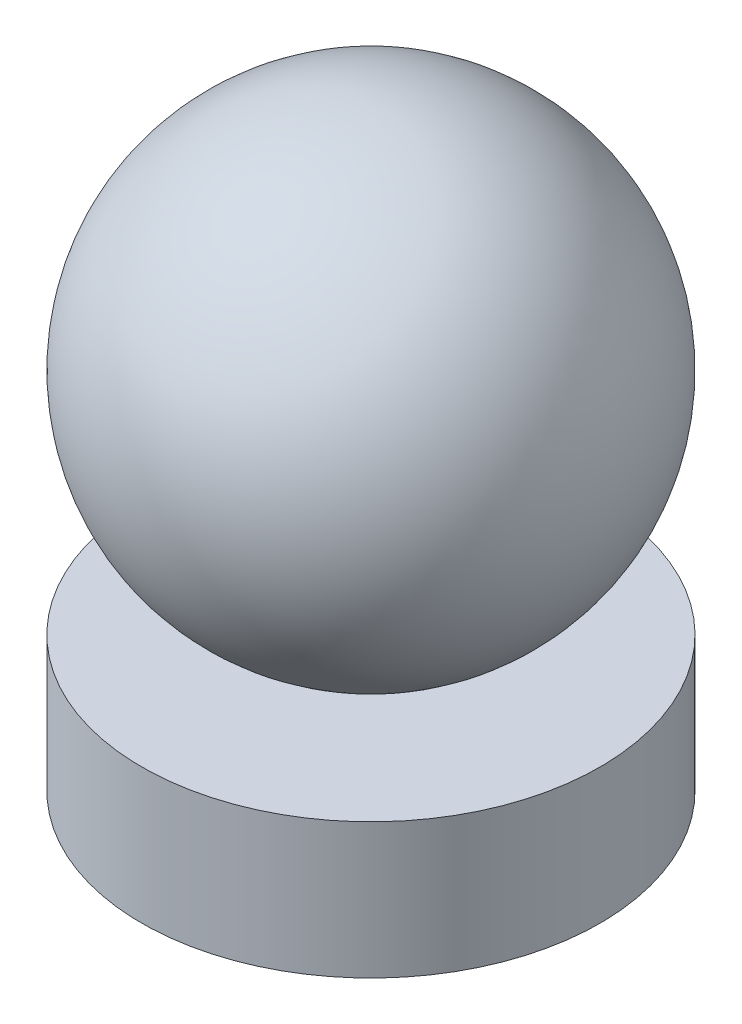
ISO-10303-21;
HEADER;
FILE_DESCRIPTION(('STEP AP214'),'2;1');
FILE_NAME('part.step','',(''),(''),'','','');
FILE_SCHEMA(('AUTOMOTIVE_DESIGN { 1 0 10303 214 1 1 1 1 }'));
ENDSEC;
DATA;
#1=APPLICATION_CONTEXT('core data for automotive mechanical design processes');
#2=APPLICATION_PROTOCOL_DEFINITION('international standard','automotive_design',2000,#1);
#3=PRODUCT_CONTEXT('',#1,'mechanical');
#4=PRODUCT('Part','Part','',(#3));
#5=PRODUCT_RELATED_PRODUCT_CATEGORY('part','',(#4));
#6=PRODUCT_DEFINITION_FORMATION('','',#4);
#7=PRODUCT_DEFINITION_CONTEXT('part definition',#1,'design');
#8=PRODUCT_DEFINITION('design','',#6,#7);
#9=PRODUCT_DEFINITION_SHAPE('','',#8);
#10=(LENGTH_UNIT() NAMED_UNIT(*) SI_UNIT(.MILLI.,.METRE.));
#11=(NAMED_UNIT(*) PLANE_ANGLE_UNIT() SI_UNIT($,.RADIAN.));
#12=(NAMED_UNIT(*) SI_UNIT($,.STERADIAN.) SOLID_ANGLE_UNIT());
#13=UNCERTAINTY_MEASURE_WITH_UNIT(LENGTH_MEASURE(1.E-05),#10,'distance_accuracy_value','');
#14=(GEOMETRIC_REPRESENTATION_CONTEXT(3) GLOBAL_UNCERTAINTY_ASSIGNED_CONTEXT((#13)) GLOBAL_UNIT_ASSIGNED_CONTEXT((#10,
#11,#12)) REPRESENTATION_CONTEXT('',''));
#15=CARTESIAN_POINT('',(0.,0.,0.));
#16=DIRECTION('',(0.,0.,1.));
#17=DIRECTION('',(1.,0.,0.));
#18=AXIS2_PLACEMENT_3D('',#15,#16,#17);
#19=CARTESIAN_POINT('',(0.,0.,0.));
#20=DIRECTION('',(0.,-1.,0.));
#21=DIRECTION('',(0.,0.,-1.));
#22=AXIS2_PLACEMENT_3D('',#19,#20,#21);
#23=PLANE('',#22);
#24=CARTESIAN_POINT('',(0.,0.,0.));
#25=DIRECTION('',(0.,-1.,0.));
#26=DIRECTION('',(0.,0.,-1.));
#27=AXIS2_PLACEMENT_3D('',#24,#25,#26);
#28=CIRCLE('',#27,3.175);
#29=CARTESIAN_POINT('',(0.,0.,-3.175));
#30=VERTEX_POINT('',#29);
#31=EDGE_CURVE('E11',#30,#30,#28,.T.);
#32=ORIENTED_EDGE('',*,*,#31,.T.);
#33=EDGE_LOOP('',(#32));
#34=FACE_BOUND('',#33,.T.);
#35=ADVANCED_FACE('F43',(#34),#23,.T.);
#36=CARTESIAN_POINT('',(0.,0.,0.));
#37=DIRECTION('',(0.,-1.,0.));
#38=DIRECTION('',(0.,0.,-1.));
#39=AXIS2_PLACEMENT_3D('',#36,#37,#38);
#40=CYLINDRICAL_SURFACE('',#39,3.175);
#41=CARTESIAN_POINT('',(0.,1.875,0.));
#42=DIRECTION('',(0.,-1.,0.));
#43=DIRECTION('',(0.,0.,-1.));
#44=AXIS2_PLACEMENT_3D('',#41,#42,#43);
#45=CIRCLE('',#44,3.175);
#46=CARTESIAN_POINT('',(0.,1.875,-3.175));
#47=VERTEX_POINT('',#46);
#48=EDGE_CURVE('E49',#47,#47,#45,.T.);
#49=ORIENTED_EDGE('',*,*,#48,.T.);
#50=EDGE_LOOP('',(#49));
#51=FACE_BOUND('',#50,.T.);
#52=ORIENTED_EDGE('',*,*,#31,.F.);
#53=EDGE_LOOP('',(#52));
#54=FACE_BOUND('',#53,.T.);
#55=ADVANCED_FACE('F55',(#51,#54),#40,.T.);
#56=CARTESIAN_POINT('',(0.,1.875,0.));
#57=DIRECTION('',(0.,-1.,0.));
#58=DIRECTION('',(0.,0.,-1.));
#59=AXIS2_PLACEMENT_3D('',#56,#57,#58);
#60=PLANE('',#59);
#61=ORIENTED_EDGE('',*,*,#48,.F.);
#62=EDGE_LOOP('',(#61));
#63=FACE_BOUND('',#62,.T.);
#64=ADVANCED_FACE('F58',(#63),#60,.F.);
#65=CLOSED_SHELL('',(#35,#55,#64));
#66=MANIFOLD_SOLID_BREP('B2',#65);
#67=CARTESIAN_POINT('',(0.,5.05,0.));
#68=DIRECTION('',(0.,-1.,0.));
#69=DIRECTION('',(-1.,0.,0.));
#70=AXIS2_PLACEMENT_3D('',#67,#68,#69);
#71=SPHERICAL_SURFACE('',#70,3.175);
#72=CARTESIAN_POINT('',(0.,1.875,0.));
#73=VERTEX_POINT('',#72);
#74=VERTEX_LOOP('',#73);
#75=FACE_BOUND('',#74,.T.);
#76=ADVANCED_FACE('F78',(#75),#71,.T.);
#77=CLOSED_SHELL('',(#76));
#78=MANIFOLD_SOLID_BREP('B6',#77);
#79=ADVANCED_BREP_SHAPE_REPRESENTATION('',(#18,#66,#78),#14);
#80=SHAPE_DEFINITION_REPRESENTATION(#9,#79);
ENDSEC;
END-ISO-10303-21;
